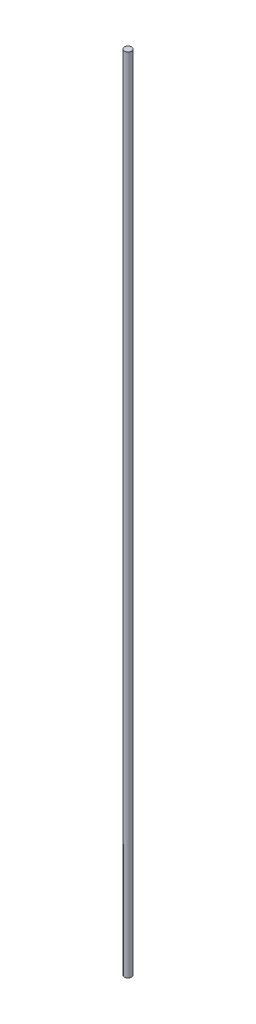
ISO-10303-21;
HEADER;
FILE_DESCRIPTION(('STEP AP214'),'2;1');
FILE_NAME('part.step','',(''),(''),'','','');
FILE_SCHEMA(('AUTOMOTIVE_DESIGN { 1 0 10303 214 1 1 1 1 }'));
ENDSEC;
DATA;
#1=APPLICATION_CONTEXT('core data for automotive mechanical design processes');
#2=APPLICATION_PROTOCOL_DEFINITION('international standard','automotive_design',2000,#1);
#3=PRODUCT_CONTEXT('',#1,'mechanical');
#4=PRODUCT('Part','Part','',(#3));
#5=PRODUCT_RELATED_PRODUCT_CATEGORY('part','',(#4));
#6=PRODUCT_DEFINITION_FORMATION('','',#4);
#7=PRODUCT_DEFINITION_CONTEXT('part definition',#1,'design');
#8=PRODUCT_DEFINITION('design','',#6,#7);
#9=PRODUCT_DEFINITION_SHAPE('','',#8);
#10=(LENGTH_UNIT() NAMED_UNIT(*) SI_UNIT(.MILLI.,.METRE.));
#11=(NAMED_UNIT(*) PLANE_ANGLE_UNIT() SI_UNIT($,.RADIAN.));
#12=(NAMED_UNIT(*) SI_UNIT($,.STERADIAN.) SOLID_ANGLE_UNIT());
#13=UNCERTAINTY_MEASURE_WITH_UNIT(LENGTH_MEASURE(1.E-05),#10,'distance_accuracy_value','');
#14=(GEOMETRIC_REPRESENTATION_CONTEXT(3) GLOBAL_UNCERTAINTY_ASSIGNED_CONTEXT((#13)) GLOBAL_UNIT_ASSIGNED_CONTEXT((#10,
#11,#12)) REPRESENTATION_CONTEXT('',''));
#15=CARTESIAN_POINT('',(0.,0.,0.));
#16=DIRECTION('',(0.,0.,1.));
#17=DIRECTION('',(1.,0.,0.));
#18=AXIS2_PLACEMENT_3D('',#15,#16,#17);
#19=CARTESIAN_POINT('',(0.,220.,0.));
#20=DIRECTION('',(0.,-1.,0.));
#21=DIRECTION('',(0.,0.,-1.));
#22=AXIS2_PLACEMENT_3D('',#19,#20,#21);
#23=CYLINDRICAL_SURFACE('',#22,1.);
#24=CARTESIAN_POINT('',(0.,220.,0.));
#25=DIRECTION('',(0.,1.,0.));
#26=DIRECTION('',(0.,0.,1.));
#27=AXIS2_PLACEMENT_3D('',#24,#25,#26);
#28=CIRCLE('',#27,1.);
#29=CARTESIAN_POINT('',(0.,220.,1.));
#30=VERTEX_POINT('',#29);
#31=EDGE_CURVE('E10',#30,#30,#28,.T.);
#32=ORIENTED_EDGE('',*,*,#31,.F.);
#33=EDGE_LOOP('',(#32));
#34=FACE_BOUND('',#33,.T.);
#35=CARTESIAN_POINT('',(0.,0.,0.));
#36=DIRECTION('',(0.,1.,0.));
#37=DIRECTION('',(0.,0.,1.));
#38=AXIS2_PLACEMENT_3D('',#35,#36,#37);
#39=CIRCLE('',#38,1.);
#40=CARTESIAN_POINT('',(0.,0.,1.));
#41=VERTEX_POINT('',#40);
#42=EDGE_CURVE('E42',#41,#41,#39,.T.);
#43=ORIENTED_EDGE('',*,*,#42,.T.);
#44=EDGE_LOOP('',(#43));
#45=FACE_BOUND('',#44,.T.);
#46=ADVANCED_FACE('F39',(#34,#45),#23,.T.);
#47=CARTESIAN_POINT('',(0.,220.,0.));
#48=DIRECTION('',(0.,1.,0.));
#49=DIRECTION('',(0.,0.,1.));
#50=AXIS2_PLACEMENT_3D('',#47,#48,#49);
#51=PLANE('',#50);
#52=ORIENTED_EDGE('',*,*,#31,.T.);
#53=EDGE_LOOP('',(#52));
#54=FACE_BOUND('',#53,.T.);
#55=ADVANCED_FACE('F56',(#54),#51,.T.);
#56=CARTESIAN_POINT('',(0.,0.,0.));
#57=DIRECTION('',(0.,1.,0.));
#58=DIRECTION('',(0.,0.,1.));
#59=AXIS2_PLACEMENT_3D('',#56,#57,#58);
#60=PLANE('',#59);
#61=ORIENTED_EDGE('',*,*,#42,.F.);
#62=EDGE_LOOP('',(#61));
#63=FACE_BOUND('',#62,.T.);
#64=ADVANCED_FACE('F54',(#63),#60,.F.);
#65=CLOSED_SHELL('',(#46,#55,#64));
#66=MANIFOLD_SOLID_BREP('B2',#65);
#67=ADVANCED_BREP_SHAPE_REPRESENTATION('',(#18,#66),#14);
#68=SHAPE_DEFINITION_REPRESENTATION(#9,#67);
ENDSEC;
END-ISO-10303-21;
